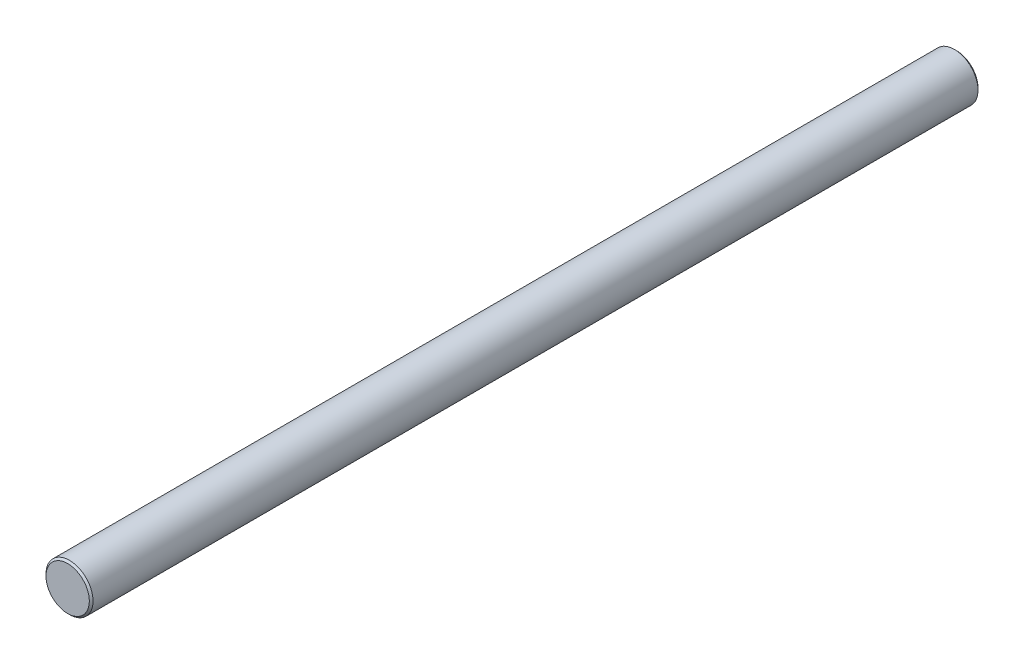
ISO-10303-21;
HEADER;
FILE_DESCRIPTION(('STEP AP214'),'2;1');
FILE_NAME('part.step','',(''),(''),'','','');
FILE_SCHEMA(('AUTOMOTIVE_DESIGN { 1 0 10303 214 1 1 1 1 }'));
ENDSEC;
DATA;
#1=APPLICATION_CONTEXT('core data for automotive mechanical design processes');
#2=APPLICATION_PROTOCOL_DEFINITION('international standard','automotive_design',2000,#1);
#3=PRODUCT_CONTEXT('',#1,'mechanical');
#4=PRODUCT('Part','Part','',(#3));
#5=PRODUCT_RELATED_PRODUCT_CATEGORY('part','',(#4));
#6=PRODUCT_DEFINITION_FORMATION('','',#4);
#7=PRODUCT_DEFINITION_CONTEXT('part definition',#1,'design');
#8=PRODUCT_DEFINITION('design','',#6,#7);
#9=PRODUCT_DEFINITION_SHAPE('','',#8);
#10=(LENGTH_UNIT() NAMED_UNIT(*) SI_UNIT(.MILLI.,.METRE.));
#11=(NAMED_UNIT(*) PLANE_ANGLE_UNIT() SI_UNIT($,.RADIAN.));
#12=(NAMED_UNIT(*) SI_UNIT($,.STERADIAN.) SOLID_ANGLE_UNIT());
#13=UNCERTAINTY_MEASURE_WITH_UNIT(LENGTH_MEASURE(1.E-05),#10,'distance_accuracy_value','');
#14=(GEOMETRIC_REPRESENTATION_CONTEXT(3) GLOBAL_UNCERTAINTY_ASSIGNED_CONTEXT((#13)) GLOBAL_UNIT_ASSIGNED_CONTEXT((#10,
#11,#12)) REPRESENTATION_CONTEXT('',''));
#15=CARTESIAN_POINT('',(0.,0.,0.));
#16=DIRECTION('',(0.,0.,1.));
#17=DIRECTION('',(1.,0.,0.));
#18=AXIS2_PLACEMENT_3D('',#15,#16,#17);
#19=CARTESIAN_POINT('',(0.,0.,240.));
#20=DIRECTION('',(0.,0.,1.));
#21=DIRECTION('',(1.,0.,0.));
#22=AXIS2_PLACEMENT_3D('',#19,#20,#21);
#23=PLANE('',#22);
#24=CARTESIAN_POINT('',(0.,0.,239.999999999952));
#25=DIRECTION('',(0.,0.,-1.));
#26=DIRECTION('',(0.,1.,0.));
#27=AXIS2_PLACEMENT_3D('',#24,#25,#26);
#28=CIRCLE('',#27,5.85000000000946);
#29=CARTESIAN_POINT('',(0.,5.85000000000946,239.999999999952));
#30=VERTEX_POINT('',#29);
#31=EDGE_CURVE('E18',#30,#30,#28,.T.);
#32=ORIENTED_EDGE('',*,*,#31,.F.);
#33=EDGE_LOOP('',(#32));
#34=FACE_BOUND('',#33,.T.);
#35=ADVANCED_FACE('F15',(#34),#23,.T.);
#36=CARTESIAN_POINT('',(0.,0.,0.));
#37=DIRECTION('',(0.,0.,1.));
#38=DIRECTION('',(1.,0.,0.));
#39=AXIS2_PLACEMENT_3D('',#36,#37,#38);
#40=PLANE('',#39);
#41=CARTESIAN_POINT('',(0.,0.,-5.6843418860808E-11));
#42=DIRECTION('',(0.,0.,1.));
#43=DIRECTION('',(1.,0.,0.));
#44=AXIS2_PLACEMENT_3D('',#41,#42,#43);
#45=CIRCLE('',#44,5.84999999995262);
#46=CARTESIAN_POINT('',(5.84999999995262,0.,-5.6843418860808E-11));
#47=VERTEX_POINT('',#46);
#48=EDGE_CURVE('E27',#47,#47,#45,.T.);
#49=ORIENTED_EDGE('',*,*,#48,.F.);
#50=EDGE_LOOP('',(#49));
#51=FACE_BOUND('',#50,.T.);
#52=ADVANCED_FACE('F38',(#51),#40,.F.);
#53=CARTESIAN_POINT('',(0.,0.,239.499999999964));
#54=DIRECTION('',(0.,0.,-1.));
#55=DIRECTION('',(0.,1.,0.));
#56=AXIS2_PLACEMENT_3D('',#53,#54,#55);
#57=CONICAL_SURFACE('',#56,6.34999999999764,0.785398163397448);
#58=CARTESIAN_POINT('',(0.,0.,239.5));
#59=DIRECTION('',(0.,0.,-1.));
#60=DIRECTION('',(-1.,0.,0.));
#61=AXIS2_PLACEMENT_3D('',#58,#59,#60);
#62=CIRCLE('',#61,6.35);
#63=CARTESIAN_POINT('',(-6.35,0.,239.5));
#64=VERTEX_POINT('',#63);
#65=EDGE_CURVE('E22',#64,#64,#62,.T.);
#66=ORIENTED_EDGE('',*,*,#65,.F.);
#67=EDGE_LOOP('',(#66));
#68=FACE_BOUND('',#67,.T.);
#69=ORIENTED_EDGE('',*,*,#31,.T.);
#70=EDGE_LOOP('',(#69));
#71=FACE_BOUND('',#70,.T.);
#72=ADVANCED_FACE('F35',(#68,#71),#57,.T.);
#73=CARTESIAN_POINT('',(0.,0.,0.499999999931333));
#74=DIRECTION('',(0.,0.,1.));
#75=DIRECTION('',(1.,0.,0.));
#76=AXIS2_PLACEMENT_3D('',#73,#74,#75);
#77=CONICAL_SURFACE('',#76,6.34999999999764,0.785398163454292);
#78=CARTESIAN_POINT('',(0.,0.,0.5));
#79=DIRECTION('',(0.,0.,-1.));
#80=DIRECTION('',(-1.,0.,0.));
#81=AXIS2_PLACEMENT_3D('',#78,#79,#80);
#82=CIRCLE('',#81,6.35);
#83=CARTESIAN_POINT('',(-6.35,0.,0.5));
#84=VERTEX_POINT('',#83);
#85=EDGE_CURVE('E10',#84,#84,#82,.F.);
#86=ORIENTED_EDGE('',*,*,#85,.F.);
#87=EDGE_LOOP('',(#86));
#88=FACE_BOUND('',#87,.T.);
#89=ORIENTED_EDGE('',*,*,#48,.T.);
#90=EDGE_LOOP('',(#89));
#91=FACE_BOUND('',#90,.T.);
#92=ADVANCED_FACE('F46',(#88,#91),#77,.T.);
#93=CARTESIAN_POINT('',(0.,0.,240.));
#94=DIRECTION('',(0.,0.,-1.));
#95=DIRECTION('',(-1.,0.,0.));
#96=AXIS2_PLACEMENT_3D('',#93,#94,#95);
#97=CYLINDRICAL_SURFACE('',#96,6.35);
#98=ORIENTED_EDGE('',*,*,#85,.T.);
#99=EDGE_LOOP('',(#98));
#100=FACE_BOUND('',#99,.T.);
#101=ORIENTED_EDGE('',*,*,#65,.T.);
#102=EDGE_LOOP('',(#101));
#103=FACE_BOUND('',#102,.T.);
#104=ADVANCED_FACE('F44',(#100,#103),#97,.T.);
#105=CLOSED_SHELL('',(#35,#52,#72,#92,#104));
#106=MANIFOLD_SOLID_BREP('B1',#105);
#107=ADVANCED_BREP_SHAPE_REPRESENTATION('',(#18,#106),#14);
#108=SHAPE_DEFINITION_REPRESENTATION(#9,#107);
ENDSEC;
END-ISO-10303-21;
